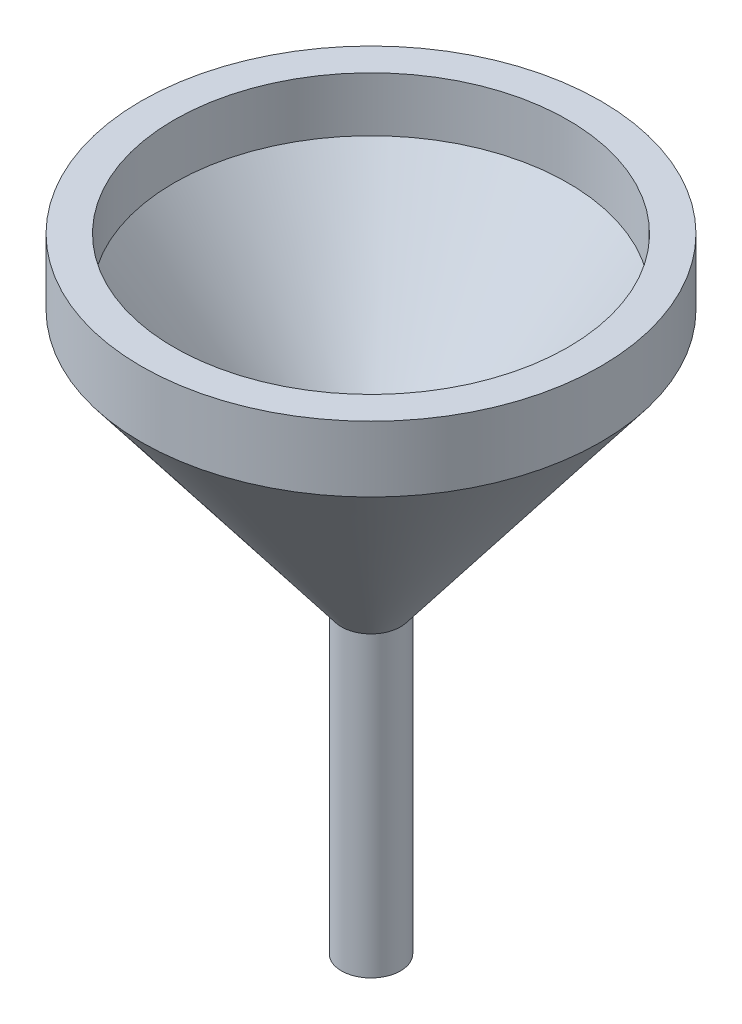
ISO-10303-21;
HEADER;
FILE_DESCRIPTION(('STEP AP214'),'2;1');
FILE_NAME('part.step','',(''),(''),'','','');
FILE_SCHEMA(('AUTOMOTIVE_DESIGN { 1 0 10303 214 1 1 1 1 }'));
ENDSEC;
DATA;
#1=APPLICATION_CONTEXT('core data for automotive mechanical design processes');
#2=APPLICATION_PROTOCOL_DEFINITION('international standard','automotive_design',2000,#1);
#3=PRODUCT_CONTEXT('',#1,'mechanical');
#4=PRODUCT('Part','Part','',(#3));
#5=PRODUCT_RELATED_PRODUCT_CATEGORY('part','',(#4));
#6=PRODUCT_DEFINITION_FORMATION('','',#4);
#7=PRODUCT_DEFINITION_CONTEXT('part definition',#1,'design');
#8=PRODUCT_DEFINITION('design','',#6,#7);
#9=PRODUCT_DEFINITION_SHAPE('','',#8);
#10=(LENGTH_UNIT() NAMED_UNIT(*) SI_UNIT(.MILLI.,.METRE.));
#11=(NAMED_UNIT(*) PLANE_ANGLE_UNIT() SI_UNIT($,.RADIAN.));
#12=(NAMED_UNIT(*) SI_UNIT($,.STERADIAN.) SOLID_ANGLE_UNIT());
#13=UNCERTAINTY_MEASURE_WITH_UNIT(LENGTH_MEASURE(1.E-05),#10,'distance_accuracy_value','');
#14=(GEOMETRIC_REPRESENTATION_CONTEXT(3) GLOBAL_UNCERTAINTY_ASSIGNED_CONTEXT((#13)) GLOBAL_UNIT_ASSIGNED_CONTEXT((#10,
#11,#12)) REPRESENTATION_CONTEXT('',''));
#15=CARTESIAN_POINT('',(0.,0.,0.));
#16=DIRECTION('',(0.,0.,1.));
#17=DIRECTION('',(1.,0.,0.));
#18=AXIS2_PLACEMENT_3D('',#15,#16,#17);
#19=CARTESIAN_POINT('',(70.,95.,0.));
#20=DIRECTION('',(0.,-1.,0.));
#21=DIRECTION('',(1.,0.,0.));
#22=AXIS2_PLACEMENT_3D('',#19,#20,#21);
#23=PLANE('',#22);
#24=CARTESIAN_POINT('',(0.,95.,0.));
#25=DIRECTION('',(0.,-1.,0.));
#26=DIRECTION('',(1.,0.,0.));
#27=AXIS2_PLACEMENT_3D('',#24,#25,#26);
#28=CIRCLE('',#27,60.);
#29=CARTESIAN_POINT('',(60.,95.,0.));
#30=VERTEX_POINT('',#29);
#31=EDGE_CURVE('E53',#30,#30,#28,.F.);
#32=ORIENTED_EDGE('',*,*,#31,.F.);
#33=EDGE_LOOP('',(#32));
#34=FACE_BOUND('',#33,.T.);
#35=CARTESIAN_POINT('',(0.,95.,0.));
#36=DIRECTION('',(0.,1.,0.));
#37=DIRECTION('',(-1.,0.,0.));
#38=AXIS2_PLACEMENT_3D('',#35,#36,#37);
#39=CIRCLE('',#38,70.);
#40=CARTESIAN_POINT('',(-70.,95.,0.));
#41=VERTEX_POINT('',#40);
#42=EDGE_CURVE('E49',#41,#41,#39,.T.);
#43=ORIENTED_EDGE('',*,*,#42,.T.);
#44=EDGE_LOOP('',(#43));
#45=FACE_BOUND('',#44,.T.);
#46=ADVANCED_FACE('F33',(#34,#45),#23,.F.);
#47=CARTESIAN_POINT('',(0.,-95.,0.));
#48=DIRECTION('',(0.,1.,0.));
#49=DIRECTION('',(-1.,0.,0.));
#50=AXIS2_PLACEMENT_3D('',#47,#48,#49);
#51=PLANE('',#50);
#52=CARTESIAN_POINT('',(0.,-95.,0.));
#53=DIRECTION('',(0.,-1.,0.));
#54=DIRECTION('',(1.,0.,0.));
#55=AXIS2_PLACEMENT_3D('',#52,#53,#54);
#56=CIRCLE('',#55,6.24982416670957);
#57=CARTESIAN_POINT('',(6.24982416670955,-95.,0.));
#58=VERTEX_POINT('',#57);
#59=EDGE_CURVE('E58',#58,#58,#56,.T.);
#60=ORIENTED_EDGE('',*,*,#59,.F.);
#61=EDGE_LOOP('',(#60));
#62=FACE_BOUND('',#61,.T.);
#63=CARTESIAN_POINT('',(0.,-95.,0.));
#64=DIRECTION('',(0.,1.,0.));
#65=DIRECTION('',(-1.,0.,0.));
#66=AXIS2_PLACEMENT_3D('',#63,#64,#65);
#67=CIRCLE('',#66,9.00000000000002);
#68=CARTESIAN_POINT('',(-9.00000000000002,-95.,0.));
#69=VERTEX_POINT('',#68);
#70=EDGE_CURVE('E10',#69,#69,#67,.T.);
#71=ORIENTED_EDGE('',*,*,#70,.F.);
#72=EDGE_LOOP('',(#71));
#73=FACE_BOUND('',#72,.T.);
#74=ADVANCED_FACE('F84',(#62,#73),#51,.F.);
#75=CARTESIAN_POINT('',(0.,95.,0.));
#76=DIRECTION('',(0.,1.,0.));
#77=DIRECTION('',(-1.,0.,0.));
#78=AXIS2_PLACEMENT_3D('',#75,#76,#77);
#79=CYLINDRICAL_SURFACE('',#78,9.00000000000001);
#80=CARTESIAN_POINT('',(0.,-4.24014134263012,0.));
#81=DIRECTION('',(0.,1.,0.));
#82=DIRECTION('',(-1.,0.,0.));
#83=AXIS2_PLACEMENT_3D('',#80,#81,#82);
#84=CIRCLE('',#83,9.00000000000001);
#85=CARTESIAN_POINT('',(-8.99999999999999,-4.24014134263012,0.));
#86=VERTEX_POINT('',#85);
#87=EDGE_CURVE('E40',#86,#86,#84,.T.);
#88=ORIENTED_EDGE('',*,*,#87,.F.);
#89=EDGE_LOOP('',(#88));
#90=FACE_BOUND('',#89,.T.);
#91=ORIENTED_EDGE('',*,*,#70,.T.);
#92=EDGE_LOOP('',(#91));
#93=FACE_BOUND('',#92,.T.);
#94=ADVANCED_FACE('F89',(#90,#93),#79,.T.);
#95=CARTESIAN_POINT('',(0.,-4.24014134263012,0.));
#96=DIRECTION('',(0.,1.,0.));
#97=DIRECTION('',(-1.,0.,0.));
#98=AXIS2_PLACEMENT_3D('',#95,#96,#97);
#99=CONICAL_SURFACE('',#98,9.00000000000001,0.656060590924923);
#100=CARTESIAN_POINT('',(0.,75.,0.));
#101=DIRECTION('',(0.,1.,0.));
#102=DIRECTION('',(-1.,0.,0.));
#103=AXIS2_PLACEMENT_3D('',#100,#101,#102);
#104=CIRCLE('',#103,70.);
#105=CARTESIAN_POINT('',(-70.,75.,0.));
#106=VERTEX_POINT('',#105);
#107=EDGE_CURVE('E44',#106,#106,#104,.T.);
#108=CARTESIAN_POINT('',(-70.,75.,0.));
#109=CARTESIAN_POINT('',(-69.3645833333333,74.1745818610143,0.));
#110=CARTESIAN_POINT('',(-68.7291666666666,73.3491637220286,0.));
#111=CARTESIAN_POINT('',(-67.4583333333333,71.6983274440571,0.));
#112=CARTESIAN_POINT('',(-66.8229166666666,70.8729093050714,0.));
#113=CARTESIAN_POINT('',(-65.5520833333333,69.2220730270999,0.));
#114=CARTESIAN_POINT('',(-64.9166666666667,68.3966548881142,0.));
#115=CARTESIAN_POINT('',(-63.6458333333333,66.7458186101427,0.));
#116=CARTESIAN_POINT('',(-63.0104166666667,65.920400471157,0.));
#117=CARTESIAN_POINT('',(-61.7395833333333,64.2695641931855,0.));
#118=CARTESIAN_POINT('',(-61.1041666666667,63.4441460541998,0.));
#119=CARTESIAN_POINT('',(-59.8333333333333,61.7933097762283,0.));
#120=CARTESIAN_POINT('',(-59.1979166666667,60.9678916372426,0.));
#121=CARTESIAN_POINT('',(-57.9270833333333,59.3170553592711,0.));
#122=CARTESIAN_POINT('',(-57.2916666666667,58.4916372202854,0.));
#123=CARTESIAN_POINT('',(-56.0208333333333,56.8408009423139,0.));
#124=CARTESIAN_POINT('',(-55.3854166666667,56.0153828033282,0.));
#125=CARTESIAN_POINT('',(-54.1145833333333,54.3645465253568,0.));
#126=CARTESIAN_POINT('',(-53.4791666666667,53.539128386371,0.));
#127=CARTESIAN_POINT('',(-52.2083333333333,51.8882921083996,0.));
#128=CARTESIAN_POINT('',(-51.5729166666667,51.0628739694138,0.));
#129=CARTESIAN_POINT('',(-50.3020833333333,49.4120376914424,0.));
#130=CARTESIAN_POINT('',(-49.6666666666667,48.5866195524566,0.));
#131=CARTESIAN_POINT('',(-48.3958333333333,46.9357832744852,0.));
#132=CARTESIAN_POINT('',(-47.7604166666667,46.1103651354994,0.));
#133=CARTESIAN_POINT('',(-46.4895833333333,44.459528857528,0.));
#134=CARTESIAN_POINT('',(-45.8541666666667,43.6341107185423,0.));
#135=CARTESIAN_POINT('',(-44.5833333333333,41.9832744405708,0.));
#136=CARTESIAN_POINT('',(-43.9479166666667,41.1578563015851,0.));
#137=CARTESIAN_POINT('',(-42.6770833333333,39.5070200236136,0.));
#138=CARTESIAN_POINT('',(-42.0416666666667,38.6816018846279,0.));
#139=CARTESIAN_POINT('',(-40.7708333333333,37.0307656066564,0.));
#140=CARTESIAN_POINT('',(-40.1354166666667,36.2053474676707,0.));
#141=CARTESIAN_POINT('',(-38.8645833333333,34.5545111896992,0.));
#142=CARTESIAN_POINT('',(-38.2291666666667,33.7290930507135,0.));
#143=CARTESIAN_POINT('',(-36.9583333333333,32.078256772742,0.));
#144=CARTESIAN_POINT('',(-36.3229166666667,31.2528386337563,0.));
#145=CARTESIAN_POINT('',(-35.0520833333333,29.6020023557848,0.));
#146=CARTESIAN_POINT('',(-34.4166666666667,28.7765842167991,0.));
#147=CARTESIAN_POINT('',(-33.1458333333333,27.1257479388276,0.));
#148=CARTESIAN_POINT('',(-32.5104166666667,26.3003297998419,0.));
#149=CARTESIAN_POINT('',(-31.2395833333333,24.6494935218705,0.));
#150=CARTESIAN_POINT('',(-30.6041666666667,23.8240753828847,0.));
#151=CARTESIAN_POINT('',(-29.3333333333333,22.1732391049133,0.));
#152=CARTESIAN_POINT('',(-28.6979166666667,21.3478209659275,0.));
#153=CARTESIAN_POINT('',(-27.4270833333333,19.6969846879561,0.));
#154=CARTESIAN_POINT('',(-26.7916666666667,18.8715665489703,0.));
#155=CARTESIAN_POINT('',(-25.5208333333333,17.2207302709989,0.));
#156=CARTESIAN_POINT('',(-24.8854166666667,16.3953121320131,0.));
#157=CARTESIAN_POINT('',(-23.6145833333333,14.7444758540417,0.));
#158=CARTESIAN_POINT('',(-22.9791666666667,13.919057715056,0.));
#159=CARTESIAN_POINT('',(-21.7083333333333,12.2682214370845,0.));
#160=CARTESIAN_POINT('',(-21.0729166666667,11.4428032980988,0.));
#161=CARTESIAN_POINT('',(-19.8020833333333,9.7919670201273,0.));
#162=CARTESIAN_POINT('',(-19.1666666666667,8.96654888114157,0.));
#163=CARTESIAN_POINT('',(-17.8958333333333,7.31571260317011,0.));
#164=CARTESIAN_POINT('',(-17.2604166666667,6.49029446418438,0.));
#165=CARTESIAN_POINT('',(-15.9895833333333,4.83945818621292,0.));
#166=CARTESIAN_POINT('',(-15.3541666666667,4.01404004722719,0.));
#167=CARTESIAN_POINT('',(-14.0833333333333,2.36320376925573,0.));
#168=CARTESIAN_POINT('',(-13.4479166666667,1.53778563026999,0.));
#169=CARTESIAN_POINT('',(-12.1770833333333,-0.113050647701473,0.));
#170=CARTESIAN_POINT('',(-11.5416666666667,-0.938468786687202,0.));
#171=CARTESIAN_POINT('',(-10.2708333333333,-2.58930506465866,0.));
#172=CARTESIAN_POINT('',(-9.63541666666666,-3.41472320364439,0.));
#173=CARTESIAN_POINT('',(-8.99999999999999,-4.24014134263012,0.));
#174=B_SPLINE_CURVE_WITH_KNOTS('',3,(#108,#109,#110,#111,#112,#113,#114,#115,#116,#117,#118,
#119,#120,#121,#122,#123,#124,#125,#126,#127,#128,#129,#130,#131,#132,#133,#134,#135,#136,#137,
#138,#139,#140,#141,#142,#143,#144,#145,#146,#147,#148,#149,#150,#151,#152,#153,#154,#155,#156,
#157,#158,#159,#160,#161,#162,#163,#164,#165,#166,#167,#168,#169,#170,#171,#172,#173),
.UNSPECIFIED.,.F.,.F.,(4,2,2,2,2,2,2,2,2,2,2,2,2,2,2,2,2,2,2,2,2,2,2,2,2,2,2,2,2,2,2,2,4),(0.,
3.125,6.24999999999999,9.375,12.5,15.625,18.75,21.875,25.,28.125,31.25,34.375,37.5,40.625,43.75,
46.875,50.,53.125,56.25,59.375,62.5,65.625,68.75,71.875,75.,78.125,81.25,84.375,87.5,90.625,
93.75,96.875,100.),.UNSPECIFIED.);
#175=EDGE_CURVE('BSEAM97',#106,#86,#174,.T.);
#176=ORIENTED_EDGE('',*,*,#107,.F.);
#177=ORIENTED_EDGE('',*,*,#87,.T.);
#178=ORIENTED_EDGE('',*,*,#175,.T.);
#179=ORIENTED_EDGE('',*,*,#175,.F.);
#180=EDGE_LOOP('',(#176,#178,#177,#179));
#181=FACE_BOUND('',#180,.T.);
#182=ADVANCED_FACE('F97',(#181),#99,.T.);
#183=CARTESIAN_POINT('',(0.,95.,0.));
#184=DIRECTION('',(0.,1.,0.));
#185=DIRECTION('',(-1.,0.,0.));
#186=AXIS2_PLACEMENT_3D('',#183,#184,#185);
#187=CYLINDRICAL_SURFACE('',#186,70.);
#188=ORIENTED_EDGE('',*,*,#42,.F.);
#189=EDGE_LOOP('',(#188));
#190=FACE_BOUND('',#189,.T.);
#191=ORIENTED_EDGE('',*,*,#107,.T.);
#192=EDGE_LOOP('',(#191));
#193=FACE_BOUND('',#192,.T.);
#194=ADVANCED_FACE('F71',(#190,#193),#187,.T.);
#195=CARTESIAN_POINT('',(0.,1.85985865736988,0.));
#196=DIRECTION('',(0.,1.,0.));
#197=DIRECTION('',(-1.,0.,0.));
#198=AXIS2_PLACEMENT_3D('',#195,#196,#197);
#199=CONICAL_SURFACE('',#198,1.075985865737,0.656060590924923);
#200=CARTESIAN_POINT('',(0.,8.58077141561545,0.));
#201=DIRECTION('',(0.,1.,0.));
#202=DIRECTION('',(-1.,0.,0.));
#203=AXIS2_PLACEMENT_3D('',#200,#201,#202);
#204=CIRCLE('',#203,6.24982416670957);
#205=CARTESIAN_POINT('',(-6.24982416670955,8.58077141561545,0.));
#206=VERTEX_POINT('',#205);
#207=EDGE_CURVE('E36',#206,#206,#204,.T.);
#208=CARTESIAN_POINT('',(0.,78.4032555176016,0.));
#209=DIRECTION('',(0.,1.,0.));
#210=DIRECTION('',(-1.,0.,0.));
#211=AXIS2_PLACEMENT_3D('',#208,#209,#210);
#212=CIRCLE('',#211,60.);
#213=CARTESIAN_POINT('',(-60.,78.4032555176016,0.));
#214=VERTEX_POINT('',#213);
#215=EDGE_CURVE('E52',#214,#214,#212,.T.);
#216=CARTESIAN_POINT('',(-6.24982416670955,8.58077141561545,0.));
#217=CARTESIAN_POINT('',(-6.80972183163966,9.30808895834447,0.));
#218=CARTESIAN_POINT('',(-7.36961949656976,10.0354065010735,0.));
#219=CARTESIAN_POINT('',(-8.48941482642998,11.4900415865315,0.));
#220=CARTESIAN_POINT('',(-9.04931249136009,12.2173591292606,0.));
#221=CARTESIAN_POINT('',(-10.1691078212203,13.6719942147186,0.));
#222=CARTESIAN_POINT('',(-10.7290054861504,14.3993117574476,0.));
#223=CARTESIAN_POINT('',(-11.8488008160106,15.8539468429057,0.));
#224=CARTESIAN_POINT('',(-12.4086984809407,16.5812643856347,0.));
#225=CARTESIAN_POINT('',(-13.528493810801,18.0358994710927,0.));
#226=CARTESIAN_POINT('',(-14.0883914757311,18.7632170138218,0.));
#227=CARTESIAN_POINT('',(-15.2081868055913,20.2178520992798,0.));
#228=CARTESIAN_POINT('',(-15.7680844705214,20.9451696420088,0.));
#229=CARTESIAN_POINT('',(-16.8878798003816,22.3998047274669,0.));
#230=CARTESIAN_POINT('',(-17.4477774653117,23.1271222701959,0.));
#231=CARTESIAN_POINT('',(-18.5675727951719,24.5817573556539,0.));
#232=CARTESIAN_POINT('',(-19.127470460102,25.309074898383,0.));
#233=CARTESIAN_POINT('',(-20.2472657899623,26.763709983841,0.));
#234=CARTESIAN_POINT('',(-20.8071634548924,27.49102752657,0.));
#235=CARTESIAN_POINT('',(-21.9269587847526,28.9456626120281,0.));
#236=CARTESIAN_POINT('',(-22.4868564496827,29.6729801547571,0.));
#237=CARTESIAN_POINT('',(-23.6066517795429,31.1276152402151,0.));
#238=CARTESIAN_POINT('',(-24.166549444473,31.8549327829442,0.));
#239=CARTESIAN_POINT('',(-25.2863447743332,33.3095678684022,0.));
#240=CARTESIAN_POINT('',(-25.8462424392633,34.0368854111312,0.));
#241=CARTESIAN_POINT('',(-26.9660377691236,35.4915204965893,0.));
#242=CARTESIAN_POINT('',(-27.5259354340537,36.2188380393183,0.));
#243=CARTESIAN_POINT('',(-28.6457307639139,37.6734731247764,0.));
#244=CARTESIAN_POINT('',(-29.205628428844,38.4007906675054,0.));
#245=CARTESIAN_POINT('',(-30.3254237587042,39.8554257529634,0.));
#246=CARTESIAN_POINT('',(-30.8853214236343,40.5827432956924,0.));
#247=CARTESIAN_POINT('',(-32.0051167534945,42.0373783811505,0.));
#248=CARTESIAN_POINT('',(-32.5650144184247,42.7646959238795,0.));
#249=CARTESIAN_POINT('',(-33.6848097482849,44.2193310093376,0.));
#250=CARTESIAN_POINT('',(-34.244707413215,44.9466485520666,0.));
#251=CARTESIAN_POINT('',(-35.3645027430752,46.4012836375246,0.));
#252=CARTESIAN_POINT('',(-35.9244004080053,47.1286011802536,0.));
#253=CARTESIAN_POINT('',(-37.0441957378655,48.5832362657117,0.));
#254=CARTESIAN_POINT('',(-37.6040934027956,49.3105538084407,0.));
#255=CARTESIAN_POINT('',(-38.7238887326558,50.7651888938988,0.));
#256=CARTESIAN_POINT('',(-39.2837863975859,51.4925064366278,0.));
#257=CARTESIAN_POINT('',(-40.4035817274462,52.9471415220858,0.));
#258=CARTESIAN_POINT('',(-40.9634793923763,53.6744590648148,0.));
#259=CARTESIAN_POINT('',(-42.0832747222365,55.1290941502729,0.));
#260=CARTESIAN_POINT('',(-42.6431723871666,55.8564116930019,0.));
#261=CARTESIAN_POINT('',(-43.7629677170268,57.31104677846,0.));
#262=CARTESIAN_POINT('',(-44.3228653819569,58.038364321189,0.));
#263=CARTESIAN_POINT('',(-45.4426607118171,59.492999406647,0.));
#264=CARTESIAN_POINT('',(-46.0025583767473,60.2203169493761,0.));
#265=CARTESIAN_POINT('',(-47.1223537066075,61.6749520348341,0.));
#266=CARTESIAN_POINT('',(-47.6822513715376,62.4022695775631,0.));
#267=CARTESIAN_POINT('',(-48.8020467013978,63.8569046630212,0.));
#268=CARTESIAN_POINT('',(-49.3619443663279,64.5842222057502,0.));
#269=CARTESIAN_POINT('',(-50.4817396961881,66.0388572912082,0.));
#270=CARTESIAN_POINT('',(-51.0416373611182,66.7661748339373,0.));
#271=CARTESIAN_POINT('',(-52.1614326909785,68.2208099193953,0.));
#272=CARTESIAN_POINT('',(-52.7213303559086,68.9481274621243,0.));
#273=CARTESIAN_POINT('',(-53.8411256857688,70.4027625475824,0.));
#274=CARTESIAN_POINT('',(-54.4010233506989,71.1300800903114,0.));
#275=CARTESIAN_POINT('',(-55.5208186805591,72.5847151757694,0.));
#276=CARTESIAN_POINT('',(-56.0807163454892,73.3120327184985,0.));
#277=CARTESIAN_POINT('',(-57.2005116753494,74.7666678039565,0.));
#278=CARTESIAN_POINT('',(-57.7604093402795,75.4939853466855,0.));
#279=CARTESIAN_POINT('',(-58.8802046701397,76.9486204321436,0.));
#280=CARTESIAN_POINT('',(-59.4401023350699,77.6759379748726,0.));
#281=CARTESIAN_POINT('',(-60.,78.4032555176016,0.));
#282=B_SPLINE_CURVE_WITH_KNOTS('',3,(#216,#217,#218,#219,#220,#221,#222,#223,#224,#225,#226,
#227,#228,#229,#230,#231,#232,#233,#234,#235,#236,#237,#238,#239,#240,#241,#242,#243,#244,#245,
#246,#247,#248,#249,#250,#251,#252,#253,#254,#255,#256,#257,#258,#259,#260,#261,#262,#263,#264,
#265,#266,#267,#268,#269,#270,#271,#272,#273,#274,#275,#276,#277,#278,#279,#280,#281),
.UNSPECIFIED.,.F.,.F.,(4,2,2,2,2,2,2,2,2,2,2,2,2,2,2,2,2,2,2,2,2,2,2,2,2,2,2,2,2,2,2,2,4),(0.,
2.75359507342676,5.50719014685353,8.26078522028029,11.0143802937071,13.7679753671338,
16.5215704405606,19.2751655139873,22.0287605874141,24.7823556608409,27.5359507342676,
30.2895458076944,33.0431408811212,35.7967359545479,38.5503310279747,41.3039261014015,
44.0575211748282,46.811116248255,49.5647113216817,52.3183063951085,55.0719014685353,
57.825496541962,60.5790916153888,63.3326866888156,66.0862817622423,68.8398768356691,
71.5934719090959,74.3470669825226,77.1006620559494,79.8542571293762,82.6078522028029,
85.3614472762297,88.1150423496565),.UNSPECIFIED.);
#283=EDGE_CURVE('BSEAM67',#206,#214,#282,.T.);
#284=ORIENTED_EDGE('',*,*,#207,.F.);
#285=ORIENTED_EDGE('',*,*,#215,.T.);
#286=ORIENTED_EDGE('',*,*,#283,.T.);
#287=ORIENTED_EDGE('',*,*,#283,.F.);
#288=EDGE_LOOP('',(#284,#286,#285,#287));
#289=FACE_BOUND('',#288,.T.);
#290=ADVANCED_FACE('F67',(#289),#199,.F.);
#291=CARTESIAN_POINT('',(0.,95.,0.));
#292=DIRECTION('',(0.,1.,0.));
#293=DIRECTION('',(-1.,0.,0.));
#294=AXIS2_PLACEMENT_3D('',#291,#292,#293);
#295=CYLINDRICAL_SURFACE('',#294,60.);
#296=ORIENTED_EDGE('',*,*,#31,.T.);
#297=EDGE_LOOP('',(#296));
#298=FACE_BOUND('',#297,.T.);
#299=ORIENTED_EDGE('',*,*,#215,.F.);
#300=EDGE_LOOP('',(#299));
#301=FACE_BOUND('',#300,.T.);
#302=ADVANCED_FACE('F70',(#298,#301),#295,.F.);
#303=CARTESIAN_POINT('',(0.,55.,0.));
#304=DIRECTION('',(0.,-1.,0.));
#305=DIRECTION('',(1.,0.,0.));
#306=AXIS2_PLACEMENT_3D('',#303,#304,#305);
#307=CYLINDRICAL_SURFACE('',#306,6.24982416670957);
#308=ORIENTED_EDGE('',*,*,#207,.T.);
#309=EDGE_LOOP('',(#308));
#310=FACE_BOUND('',#309,.T.);
#311=ORIENTED_EDGE('',*,*,#59,.T.);
#312=EDGE_LOOP('',(#311));
#313=FACE_BOUND('',#312,.T.);
#314=ADVANCED_FACE('F65',(#310,#313),#307,.F.);
#315=CLOSED_SHELL('',(#46,#74,#94,#182,#194,#290,#302,#314));
#316=MANIFOLD_SOLID_BREP('B2',#315);
#317=ADVANCED_BREP_SHAPE_REPRESENTATION('',(#18,#316),#14);
#318=SHAPE_DEFINITION_REPRESENTATION(#9,#317);
ENDSEC;
END-ISO-10303-21;
